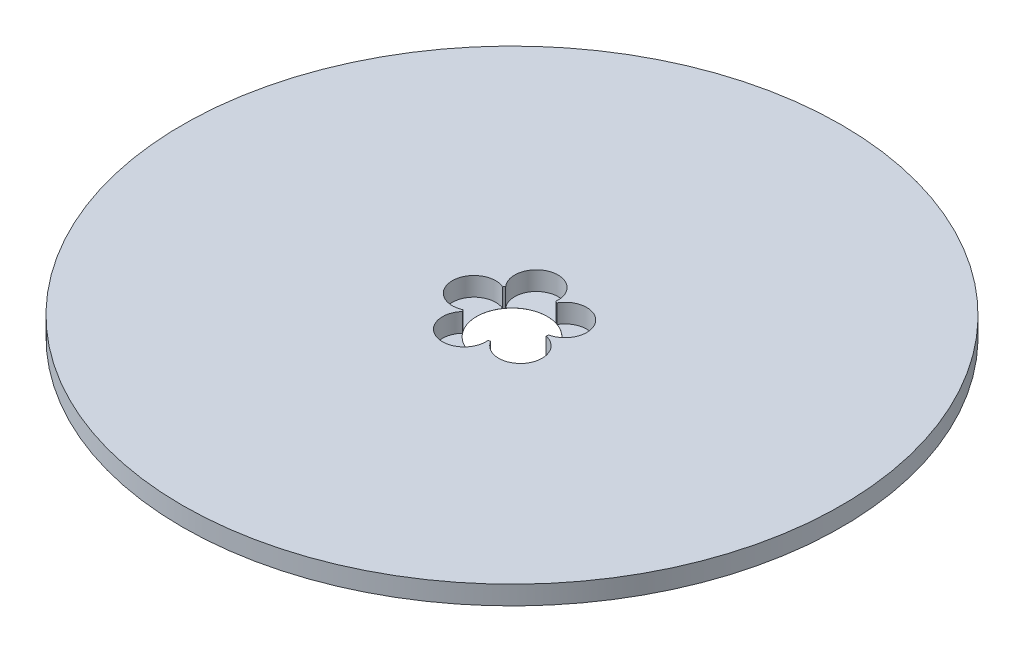
ISO-10303-21;
HEADER;
FILE_DESCRIPTION(('STEP AP214'),'2;1');
FILE_NAME('part.step','',(''),(''),'','','');
FILE_SCHEMA(('AUTOMOTIVE_DESIGN { 1 0 10303 214 1 1 1 1 }'));
ENDSEC;
DATA;
#1=APPLICATION_CONTEXT('core data for automotive mechanical design processes');
#2=APPLICATION_PROTOCOL_DEFINITION('international standard','automotive_design',2000,#1);
#3=PRODUCT_CONTEXT('',#1,'mechanical');
#4=PRODUCT('Part','Part','',(#3));
#5=PRODUCT_RELATED_PRODUCT_CATEGORY('part','',(#4));
#6=PRODUCT_DEFINITION_FORMATION('','',#4);
#7=PRODUCT_DEFINITION_CONTEXT('part definition',#1,'design');
#8=PRODUCT_DEFINITION('design','',#6,#7);
#9=PRODUCT_DEFINITION_SHAPE('','',#8);
#10=(LENGTH_UNIT() NAMED_UNIT(*) SI_UNIT(.MILLI.,.METRE.));
#11=(NAMED_UNIT(*) PLANE_ANGLE_UNIT() SI_UNIT($,.RADIAN.));
#12=(NAMED_UNIT(*) SI_UNIT($,.STERADIAN.) SOLID_ANGLE_UNIT());
#13=UNCERTAINTY_MEASURE_WITH_UNIT(LENGTH_MEASURE(1.E-05),#10,'distance_accuracy_value','');
#14=(GEOMETRIC_REPRESENTATION_CONTEXT(3) GLOBAL_UNCERTAINTY_ASSIGNED_CONTEXT((#13)) GLOBAL_UNIT_ASSIGNED_CONTEXT((#10,
#11,#12)) REPRESENTATION_CONTEXT('',''));
#15=CARTESIAN_POINT('',(0.,0.,0.));
#16=DIRECTION('',(0.,0.,1.));
#17=DIRECTION('',(1.,0.,0.));
#18=AXIS2_PLACEMENT_3D('',#15,#16,#17);
#19=CARTESIAN_POINT('',(0.,4.,0.));
#20=DIRECTION('',(0.,-1.,0.));
#21=DIRECTION('',(0.,0.,-1.));
#22=AXIS2_PLACEMENT_3D('',#19,#20,#21);
#23=CYLINDRICAL_SURFACE('',#22,70.);
#24=CARTESIAN_POINT('',(0.,4.,0.));
#25=DIRECTION('',(0.,1.,0.));
#26=DIRECTION('',(0.,0.,1.));
#27=AXIS2_PLACEMENT_3D('',#24,#25,#26);
#28=CIRCLE('',#27,70.);
#29=CARTESIAN_POINT('',(0.,4.,70.));
#30=VERTEX_POINT('',#29);
#31=EDGE_CURVE('E156',#30,#30,#28,.T.);
#32=ORIENTED_EDGE('',*,*,#31,.F.);
#33=EDGE_LOOP('',(#32));
#34=FACE_BOUND('',#33,.T.);
#35=CARTESIAN_POINT('',(0.,0.,0.));
#36=DIRECTION('',(0.,1.,0.));
#37=DIRECTION('',(0.,0.,1.));
#38=AXIS2_PLACEMENT_3D('',#35,#36,#37);
#39=CIRCLE('',#38,70.);
#40=CARTESIAN_POINT('',(0.,0.,70.));
#41=VERTEX_POINT('',#40);
#42=EDGE_CURVE('E145',#41,#41,#39,.T.);
#43=ORIENTED_EDGE('',*,*,#42,.T.);
#44=EDGE_LOOP('',(#43));
#45=FACE_BOUND('',#44,.T.);
#46=ADVANCED_FACE('F39',(#34,#45),#23,.T.);
#47=CARTESIAN_POINT('',(0.,4.,0.));
#48=DIRECTION('',(0.,1.,0.));
#49=DIRECTION('',(0.,0.,1.));
#50=AXIS2_PLACEMENT_3D('',#47,#48,#49);
#51=PLANE('',#50);
#52=CARTESIAN_POINT('',(6.52733102201411,4.,4.74238358186189));
#53=DIRECTION('',(0.,1.,0.));
#54=DIRECTION('',(0.587785252292469,0.,-0.809016994374951));
#55=AXIS2_PLACEMENT_3D('',#52,#53,#54);
#56=CIRCLE('',#55,4.61149085907021);
#57=CARTESIAN_POINT('',(2.53890842390202,4.,7.05719094364318));
#58=VERTEX_POINT('',#57);
#59=CARTESIAN_POINT('',(7.49635328383843,4.,0.233853466693874));
#60=VERTEX_POINT('',#59);
#61=EDGE_CURVE('E139',#58,#60,#56,.T.);
#62=ORIENTED_EDGE('',*,*,#61,.F.);
#63=CARTESIAN_POINT('',(0.,4.,0.));
#64=DIRECTION('',(0.,1.,0.));
#65=DIRECTION('',(0.,0.,1.));
#66=AXIS2_PLACEMENT_3D('',#63,#64,#65);
#67=CIRCLE('',#66,7.5);
#68=CARTESIAN_POINT('',(2.09409269718708,4.,7.20172033444702));
#69=VERTEX_POINT('',#68);
#70=EDGE_CURVE('E132',#69,#58,#67,.T.);
#71=ORIENTED_EDGE('',*,*,#70,.F.);
#72=CARTESIAN_POINT('',(-2.49321859458777,4.,7.67333782314207));
#73=DIRECTION('',(0.,1.,0.));
#74=DIRECTION('',(0.951056516295155,0.,0.309016994374945));
#75=AXIS2_PLACEMENT_3D('',#72,#73,#74);
#76=CIRCLE('',#75,4.61149085907021);
#77=CARTESIAN_POINT('',(-5.92722158354357,4.,4.59543733496337));
#78=VERTEX_POINT('',#77);
#79=EDGE_CURVE('E111',#78,#69,#76,.T.);
#80=ORIENTED_EDGE('',*,*,#79,.F.);
#81=CARTESIAN_POINT('',(-6.20213282138389,4.,4.21705447746561));
#82=VERTEX_POINT('',#81);
#83=EDGE_CURVE('E143',#82,#78,#67,.T.);
#84=ORIENTED_EDGE('',*,*,#83,.F.);
#85=CARTESIAN_POINT('',(-8.06822485485258,4.,0.));
#86=DIRECTION('',(0.,1.,0.));
#87=DIRECTION('',(0.,0.,1.));
#88=AXIS2_PLACEMENT_3D('',#85,#86,#87);
#89=CIRCLE('',#88,4.61149085907021);
#90=CARTESIAN_POINT('',(-6.20213282138389,4.,-4.21705447746561));
#91=VERTEX_POINT('',#90);
#92=EDGE_CURVE('E147',#91,#82,#89,.T.);
#93=ORIENTED_EDGE('',*,*,#92,.F.);
#94=CARTESIAN_POINT('',(-5.92722158354363,4.,-4.59543733496329));
#95=VERTEX_POINT('',#94);
#96=EDGE_CURVE('E144',#95,#91,#67,.T.);
#97=ORIENTED_EDGE('',*,*,#96,.F.);
#98=CARTESIAN_POINT('',(-2.49321859458788,4.,-7.67333782314204));
#99=DIRECTION('',(0.,1.,0.));
#100=DIRECTION('',(-0.95105651629515,0.,0.309016994374958));
#101=AXIS2_PLACEMENT_3D('',#98,#99,#100);
#102=CIRCLE('',#101,4.61149085907021);
#103=CARTESIAN_POINT('',(2.09409269718698,4.,-7.20172033444705));
#104=VERTEX_POINT('',#103);
#105=EDGE_CURVE('E326',#104,#95,#102,.T.);
#106=ORIENTED_EDGE('',*,*,#105,.F.);
#107=CARTESIAN_POINT('',(2.53890842390192,4.,-7.05719094364322));
#108=VERTEX_POINT('',#107);
#109=EDGE_CURVE('E150',#108,#104,#67,.T.);
#110=ORIENTED_EDGE('',*,*,#109,.F.);
#111=CARTESIAN_POINT('',(6.52733102201404,4.,-4.74238358186198));
#112=DIRECTION('',(0.,1.,0.));
#113=DIRECTION('',(-0.58778525229248,0.,-0.809016994374942));
#114=AXIS2_PLACEMENT_3D('',#111,#112,#113);
#115=CIRCLE('',#114,4.61149085907021);
#116=CARTESIAN_POINT('',(7.49635328383843,4.,-0.233853466693981));
#117=VERTEX_POINT('',#116);
#118=EDGE_CURVE('E341',#117,#108,#115,.T.);
#119=ORIENTED_EDGE('',*,*,#118,.F.);
#120=EDGE_CURVE('E142',#60,#117,#67,.T.);
#121=ORIENTED_EDGE('',*,*,#120,.F.);
#122=EDGE_LOOP('',(#62,#71,#80,#84,#93,#97,#106,#110,#119,#121));
#123=FACE_BOUND('',#122,.T.);
#124=ORIENTED_EDGE('',*,*,#31,.T.);
#125=EDGE_LOOP('',(#124));
#126=FACE_BOUND('',#125,.T.);
#127=ADVANCED_FACE('F140',(#123,#126),#51,.T.);
#128=CARTESIAN_POINT('',(0.,0.,0.));
#129=DIRECTION('',(0.,1.,0.));
#130=DIRECTION('',(0.,0.,1.));
#131=AXIS2_PLACEMENT_3D('',#128,#129,#130);
#132=PLANE('',#131);
#133=CARTESIAN_POINT('',(0.,0.,0.));
#134=DIRECTION('',(0.,1.,0.));
#135=DIRECTION('',(0.,0.,1.));
#136=AXIS2_PLACEMENT_3D('',#133,#134,#135);
#137=CIRCLE('',#136,7.5);
#138=CARTESIAN_POINT('',(0.,0.,7.5));
#139=VERTEX_POINT('',#138);
#140=EDGE_CURVE('E155',#139,#139,#137,.T.);
#141=ORIENTED_EDGE('',*,*,#140,.T.);
#142=EDGE_LOOP('',(#141));
#143=FACE_BOUND('',#142,.T.);
#144=ORIENTED_EDGE('',*,*,#42,.F.);
#145=EDGE_LOOP('',(#144));
#146=FACE_BOUND('',#145,.T.);
#147=ADVANCED_FACE('F210',(#143,#146),#132,.F.);
#148=CARTESIAN_POINT('',(0.,4.,0.));
#149=DIRECTION('',(0.,-1.,0.));
#150=DIRECTION('',(0.,0.,-1.));
#151=AXIS2_PLACEMENT_3D('',#148,#149,#150);
#152=CYLINDRICAL_SURFACE('',#151,7.5);
#153=DIRECTION('',(0.,1.,0.));
#154=VECTOR('',#153,1.);
#155=CARTESIAN_POINT('',(2.53890842390202,2.00437911319297,7.05719094364318));
#156=LINE('',#155,#154);
#157=CARTESIAN_POINT('',(2.53890842390202,0.00875822638593971,7.05719094364318));
#158=VERTEX_POINT('',#157);
#159=EDGE_CURVE('E11',#158,#58,#156,.T.);
#160=ORIENTED_EDGE('',*,*,#159,.F.);
#161=CARTESIAN_POINT('',(0.,0.00875822638593971,0.));
#162=DIRECTION('',(0.,1.,0.));
#163=DIRECTION('',(0.,0.,1.));
#164=AXIS2_PLACEMENT_3D('',#161,#162,#163);
#165=CIRCLE('',#164,7.5);
#166=CARTESIAN_POINT('',(7.49635328383843,0.00875822638593971,0.233853466693874));
#167=VERTEX_POINT('',#166);
#168=EDGE_CURVE('E190',#158,#167,#165,.T.);
#169=ORIENTED_EDGE('',*,*,#168,.T.);
#170=DIRECTION('',(0.,1.,0.));
#171=VECTOR('',#170,1.);
#172=CARTESIAN_POINT('',(7.49635328383843,2.00437911319297,0.233853466693874));
#173=LINE('',#172,#171);
#174=EDGE_CURVE('E46',#60,#167,#173,.F.);
#175=ORIENTED_EDGE('',*,*,#174,.F.);
#176=ORIENTED_EDGE('',*,*,#120,.T.);
#177=DIRECTION('',(0.,1.,0.));
#178=VECTOR('',#177,1.);
#179=CARTESIAN_POINT('',(7.49635328383843,2.00437911319297,-0.233853466693981));
#180=LINE('',#179,#178);
#181=CARTESIAN_POINT('',(7.49635328383843,0.00875822638593971,-0.233853466693981));
#182=VERTEX_POINT('',#181);
#183=EDGE_CURVE('E183',#182,#117,#180,.T.);
#184=ORIENTED_EDGE('',*,*,#183,.F.);
#185=CARTESIAN_POINT('',(0.,0.00875822638593971,0.));
#186=DIRECTION('',(0.,1.,0.));
#187=DIRECTION('',(0.,0.,1.));
#188=AXIS2_PLACEMENT_3D('',#185,#186,#187);
#189=CIRCLE('',#188,7.5);
#190=CARTESIAN_POINT('',(2.53890842390192,0.00875822638593971,-7.05719094364322));
#191=VERTEX_POINT('',#190);
#192=EDGE_CURVE('E179',#182,#191,#189,.T.);
#193=ORIENTED_EDGE('',*,*,#192,.T.);
#194=DIRECTION('',(0.,1.,0.));
#195=VECTOR('',#194,1.);
#196=CARTESIAN_POINT('',(2.53890842390192,2.00437911319297,-7.05719094364322));
#197=LINE('',#196,#195);
#198=EDGE_CURVE('E181',#108,#191,#197,.F.);
#199=ORIENTED_EDGE('',*,*,#198,.F.);
#200=ORIENTED_EDGE('',*,*,#109,.T.);
#201=DIRECTION('',(0.,1.,0.));
#202=VECTOR('',#201,1.);
#203=CARTESIAN_POINT('',(2.09409269718698,2.00437911319297,-7.20172033444705));
#204=LINE('',#203,#202);
#205=CARTESIAN_POINT('',(2.09409269718698,0.00875822638593971,-7.20172033444705));
#206=VERTEX_POINT('',#205);
#207=EDGE_CURVE('E177',#206,#104,#204,.T.);
#208=ORIENTED_EDGE('',*,*,#207,.F.);
#209=CARTESIAN_POINT('',(0.,0.00875822638593971,0.));
#210=DIRECTION('',(0.,1.,0.));
#211=DIRECTION('',(0.,0.,1.));
#212=AXIS2_PLACEMENT_3D('',#209,#210,#211);
#213=CIRCLE('',#212,7.5);
#214=CARTESIAN_POINT('',(-5.92722158354363,0.00875822638593971,-4.59543733496329));
#215=VERTEX_POINT('',#214);
#216=EDGE_CURVE('E175',#206,#215,#213,.T.);
#217=ORIENTED_EDGE('',*,*,#216,.T.);
#218=DIRECTION('',(0.,1.,0.));
#219=VECTOR('',#218,1.);
#220=CARTESIAN_POINT('',(-5.92722158354363,2.00437911319297,-4.59543733496329));
#221=LINE('',#220,#219);
#222=EDGE_CURVE('E174',#95,#215,#221,.F.);
#223=ORIENTED_EDGE('',*,*,#222,.F.);
#224=ORIENTED_EDGE('',*,*,#96,.T.);
#225=DIRECTION('',(0.,1.,0.));
#226=VECTOR('',#225,1.);
#227=CARTESIAN_POINT('',(-6.20213282138389,2.00437911319297,-4.21705447746561));
#228=LINE('',#227,#226);
#229=CARTESIAN_POINT('',(-6.20213282138389,0.00875822638593971,-4.21705447746561));
#230=VERTEX_POINT('',#229);
#231=EDGE_CURVE('E170',#230,#91,#228,.T.);
#232=ORIENTED_EDGE('',*,*,#231,.F.);
#233=CARTESIAN_POINT('',(0.,0.00875822638593971,0.));
#234=DIRECTION('',(0.,1.,0.));
#235=DIRECTION('',(0.,0.,1.));
#236=AXIS2_PLACEMENT_3D('',#233,#234,#235);
#237=CIRCLE('',#236,7.5);
#238=CARTESIAN_POINT('',(-6.20213282138389,0.00875822638593971,4.21705447746561));
#239=VERTEX_POINT('',#238);
#240=EDGE_CURVE('E157',#230,#239,#237,.T.);
#241=ORIENTED_EDGE('',*,*,#240,.T.);
#242=DIRECTION('',(0.,1.,0.));
#243=VECTOR('',#242,1.);
#244=CARTESIAN_POINT('',(-6.20213282138389,2.00437911319297,4.21705447746561));
#245=LINE('',#244,#243);
#246=EDGE_CURVE('E163',#82,#239,#245,.F.);
#247=ORIENTED_EDGE('',*,*,#246,.F.);
#248=ORIENTED_EDGE('',*,*,#83,.T.);
#249=DIRECTION('',(0.,1.,0.));
#250=VECTOR('',#249,1.);
#251=CARTESIAN_POINT('',(-5.92722158354357,2.00437911319297,4.59543733496337));
#252=LINE('',#251,#250);
#253=CARTESIAN_POINT('',(-5.92722158354357,0.00875822638593971,4.59543733496337));
#254=VERTEX_POINT('',#253);
#255=EDGE_CURVE('E121',#254,#78,#252,.T.);
#256=ORIENTED_EDGE('',*,*,#255,.F.);
#257=CARTESIAN_POINT('',(0.,0.00875822638593971,0.));
#258=DIRECTION('',(0.,1.,0.));
#259=DIRECTION('',(0.,0.,1.));
#260=AXIS2_PLACEMENT_3D('',#257,#258,#259);
#261=CIRCLE('',#260,7.5);
#262=CARTESIAN_POINT('',(2.09409269718708,0.00875822638593971,7.20172033444702));
#263=VERTEX_POINT('',#262);
#264=EDGE_CURVE('E133',#254,#263,#261,.T.);
#265=ORIENTED_EDGE('',*,*,#264,.T.);
#266=DIRECTION('',(0.,1.,0.));
#267=VECTOR('',#266,1.);
#268=CARTESIAN_POINT('',(2.09409269718708,2.00437911319297,7.20172033444702));
#269=LINE('',#268,#267);
#270=EDGE_CURVE('E117',#69,#263,#269,.F.);
#271=ORIENTED_EDGE('',*,*,#270,.F.);
#272=ORIENTED_EDGE('',*,*,#70,.T.);
#273=EDGE_LOOP('',(#160,#169,#175,#176,#184,#193,#199,#200,#208,#217,#223,#224,#232,#241,#247,
#248,#256,#265,#271,#272));
#274=FACE_BOUND('',#273,.T.);
#275=ORIENTED_EDGE('',*,*,#140,.F.);
#276=EDGE_LOOP('',(#275));
#277=FACE_BOUND('',#276,.T.);
#278=ADVANCED_FACE('F131',(#274,#277),#152,.F.);
#279=CARTESIAN_POINT('',(-8.06822485485258,0.00875822638593971,0.));
#280=DIRECTION('',(0.,1.,0.));
#281=DIRECTION('',(0.,0.,1.));
#282=AXIS2_PLACEMENT_3D('',#279,#280,#281);
#283=CYLINDRICAL_SURFACE('',#282,4.61149085907021);
#284=ORIENTED_EDGE('',*,*,#231,.T.);
#285=ORIENTED_EDGE('',*,*,#92,.T.);
#286=ORIENTED_EDGE('',*,*,#246,.T.);
#287=CARTESIAN_POINT('',(-8.06822485485258,0.00875822638593971,0.));
#288=DIRECTION('',(0.,1.,0.));
#289=DIRECTION('',(0.,0.,1.));
#290=AXIS2_PLACEMENT_3D('',#287,#288,#289);
#291=CIRCLE('',#290,4.61149085907021);
#292=EDGE_CURVE('E154',#230,#239,#291,.T.);
#293=ORIENTED_EDGE('',*,*,#292,.F.);
#294=EDGE_LOOP('',(#284,#285,#286,#293));
#295=FACE_BOUND('',#294,.T.);
#296=ADVANCED_FACE('F217',(#295),#283,.F.);
#297=CARTESIAN_POINT('',(-8.06822485485258,0.00875822638593971,0.));
#298=DIRECTION('',(0.,1.,0.));
#299=DIRECTION('',(0.,0.,1.));
#300=AXIS2_PLACEMENT_3D('',#297,#298,#299);
#301=PLANE('',#300);
#302=ORIENTED_EDGE('',*,*,#292,.T.);
#303=ORIENTED_EDGE('',*,*,#240,.F.);
#304=EDGE_LOOP('',(#302,#303));
#305=FACE_BOUND('',#304,.T.);
#306=ADVANCED_FACE('F225',(#305),#301,.T.);
#307=CARTESIAN_POINT('',(-2.49321859458777,0.00875822638593971,7.67333782314207));
#308=DIRECTION('',(0.,1.,0.));
#309=DIRECTION('',(0.,0.,1.));
#310=AXIS2_PLACEMENT_3D('',#307,#308,#309);
#311=CYLINDRICAL_SURFACE('',#310,4.61149085907021);
#312=ORIENTED_EDGE('',*,*,#255,.T.);
#313=ORIENTED_EDGE('',*,*,#79,.T.);
#314=ORIENTED_EDGE('',*,*,#270,.T.);
#315=CARTESIAN_POINT('',(-2.49321859458777,0.00875822638593971,7.67333782314207));
#316=DIRECTION('',(0.,1.,0.));
#317=DIRECTION('',(0.951056516295155,0.,0.309016994374945));
#318=AXIS2_PLACEMENT_3D('',#315,#316,#317);
#319=CIRCLE('',#318,4.61149085907021);
#320=EDGE_CURVE('E127',#254,#263,#319,.T.);
#321=ORIENTED_EDGE('',*,*,#320,.F.);
#322=EDGE_LOOP('',(#312,#313,#314,#321));
#323=FACE_BOUND('',#322,.T.);
#324=ADVANCED_FACE('F116',(#323),#311,.F.);
#325=CARTESIAN_POINT('',(-2.49321859458777,0.00875822638593971,7.67333782314207));
#326=DIRECTION('',(0.,1.,0.));
#327=DIRECTION('',(0.951056516295155,0.,0.309016994374945));
#328=AXIS2_PLACEMENT_3D('',#325,#326,#327);
#329=PLANE('',#328);
#330=ORIENTED_EDGE('',*,*,#320,.T.);
#331=ORIENTED_EDGE('',*,*,#264,.F.);
#332=EDGE_LOOP('',(#330,#331));
#333=FACE_BOUND('',#332,.T.);
#334=ADVANCED_FACE('F228',(#333),#329,.T.);
#335=CARTESIAN_POINT('',(-2.49321859458788,0.00875822638593971,-7.67333782314204));
#336=DIRECTION('',(0.,1.,0.));
#337=DIRECTION('',(0.,0.,1.));
#338=AXIS2_PLACEMENT_3D('',#335,#336,#337);
#339=CYLINDRICAL_SURFACE('',#338,4.61149085907021);
#340=ORIENTED_EDGE('',*,*,#207,.T.);
#341=ORIENTED_EDGE('',*,*,#105,.T.);
#342=ORIENTED_EDGE('',*,*,#222,.T.);
#343=CARTESIAN_POINT('',(-2.49321859458788,0.00875822638593971,-7.67333782314204));
#344=DIRECTION('',(0.,1.,0.));
#345=DIRECTION('',(-0.95105651629515,0.,0.309016994374958));
#346=AXIS2_PLACEMENT_3D('',#343,#344,#345);
#347=CIRCLE('',#346,4.61149085907021);
#348=EDGE_CURVE('E327',#206,#215,#347,.T.);
#349=ORIENTED_EDGE('',*,*,#348,.F.);
#350=EDGE_LOOP('',(#340,#341,#342,#349));
#351=FACE_BOUND('',#350,.T.);
#352=ADVANCED_FACE('F235',(#351),#339,.F.);
#353=CARTESIAN_POINT('',(-2.49321859458788,0.00875822638593971,-7.67333782314204));
#354=DIRECTION('',(0.,1.,0.));
#355=DIRECTION('',(-0.95105651629515,0.,0.309016994374958));
#356=AXIS2_PLACEMENT_3D('',#353,#354,#355);
#357=PLANE('',#356);
#358=ORIENTED_EDGE('',*,*,#348,.T.);
#359=ORIENTED_EDGE('',*,*,#216,.F.);
#360=EDGE_LOOP('',(#358,#359));
#361=FACE_BOUND('',#360,.T.);
#362=ADVANCED_FACE('F240',(#361),#357,.T.);
#363=CARTESIAN_POINT('',(6.52733102201404,0.00875822638593971,-4.74238358186198));
#364=DIRECTION('',(0.,1.,0.));
#365=DIRECTION('',(0.,0.,1.));
#366=AXIS2_PLACEMENT_3D('',#363,#364,#365);
#367=CYLINDRICAL_SURFACE('',#366,4.61149085907021);
#368=ORIENTED_EDGE('',*,*,#183,.T.);
#369=ORIENTED_EDGE('',*,*,#118,.T.);
#370=ORIENTED_EDGE('',*,*,#198,.T.);
#371=CARTESIAN_POINT('',(6.52733102201404,0.00875822638593971,-4.74238358186198));
#372=DIRECTION('',(0.,1.,0.));
#373=DIRECTION('',(-0.58778525229248,0.,-0.809016994374942));
#374=AXIS2_PLACEMENT_3D('',#371,#372,#373);
#375=CIRCLE('',#374,4.61149085907021);
#376=EDGE_CURVE('E56',#182,#191,#375,.T.);
#377=ORIENTED_EDGE('',*,*,#376,.F.);
#378=EDGE_LOOP('',(#368,#369,#370,#377));
#379=FACE_BOUND('',#378,.T.);
#380=ADVANCED_FACE('F233',(#379),#367,.F.);
#381=CARTESIAN_POINT('',(6.52733102201404,0.00875822638593971,-4.74238358186198));
#382=DIRECTION('',(0.,1.,0.));
#383=DIRECTION('',(-0.58778525229248,0.,-0.809016994374942));
#384=AXIS2_PLACEMENT_3D('',#381,#382,#383);
#385=PLANE('',#384);
#386=ORIENTED_EDGE('',*,*,#376,.T.);
#387=ORIENTED_EDGE('',*,*,#192,.F.);
#388=EDGE_LOOP('',(#386,#387));
#389=FACE_BOUND('',#388,.T.);
#390=ADVANCED_FACE('F196',(#389),#385,.T.);
#391=CARTESIAN_POINT('',(6.52733102201411,0.00875822638593971,4.74238358186189));
#392=DIRECTION('',(0.,1.,0.));
#393=DIRECTION('',(0.,0.,1.));
#394=AXIS2_PLACEMENT_3D('',#391,#392,#393);
#395=CYLINDRICAL_SURFACE('',#394,4.61149085907021);
#396=ORIENTED_EDGE('',*,*,#159,.T.);
#397=ORIENTED_EDGE('',*,*,#61,.T.);
#398=ORIENTED_EDGE('',*,*,#174,.T.);
#399=CARTESIAN_POINT('',(6.52733102201411,0.00875822638593971,4.74238358186189));
#400=DIRECTION('',(0.,1.,0.));
#401=DIRECTION('',(0.587785252292469,0.,-0.809016994374951));
#402=AXIS2_PLACEMENT_3D('',#399,#400,#401);
#403=CIRCLE('',#402,4.61149085907021);
#404=EDGE_CURVE('E55',#158,#167,#403,.T.);
#405=ORIENTED_EDGE('',*,*,#404,.F.);
#406=EDGE_LOOP('',(#396,#397,#398,#405));
#407=FACE_BOUND('',#406,.T.);
#408=ADVANCED_FACE('F191',(#407),#395,.F.);
#409=CARTESIAN_POINT('',(6.52733102201411,0.00875822638593971,4.74238358186189));
#410=DIRECTION('',(0.,1.,0.));
#411=DIRECTION('',(0.587785252292469,0.,-0.809016994374951));
#412=AXIS2_PLACEMENT_3D('',#409,#410,#411);
#413=PLANE('',#412);
#414=ORIENTED_EDGE('',*,*,#404,.T.);
#415=ORIENTED_EDGE('',*,*,#168,.F.);
#416=EDGE_LOOP('',(#414,#415));
#417=FACE_BOUND('',#416,.T.);
#418=ADVANCED_FACE('F195',(#417),#413,.T.);
#419=CLOSED_SHELL('',(#46,#127,#147,#278,#296,#306,#324,#334,#352,#362,#380,#390,#408,#418));
#420=MANIFOLD_SOLID_BREP('B2',#419);
#421=ADVANCED_BREP_SHAPE_REPRESENTATION('',(#18,#420),#14);
#422=SHAPE_DEFINITION_REPRESENTATION(#9,#421);
ENDSEC;
END-ISO-10303-21;
